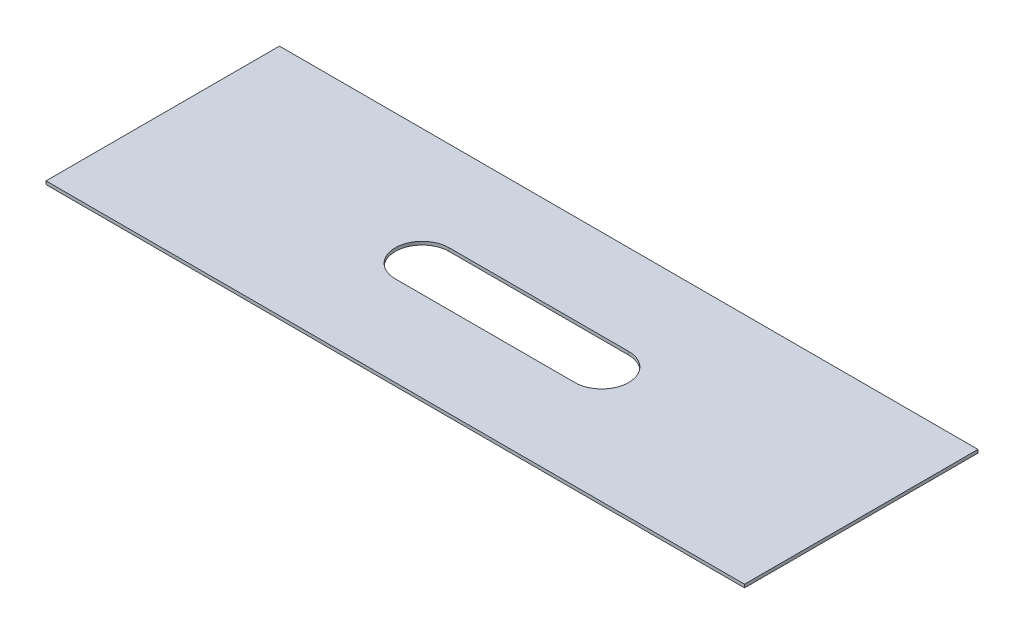
ISO-10303-21;
HEADER;
FILE_DESCRIPTION(('STEP AP214'),'2;1');
FILE_NAME('part.step','',(''),(''),'','','');
FILE_SCHEMA(('AUTOMOTIVE_DESIGN { 1 0 10303 214 1 1 1 1 }'));
ENDSEC;
DATA;
#1=APPLICATION_CONTEXT('core data for automotive mechanical design processes');
#2=APPLICATION_PROTOCOL_DEFINITION('international standard','automotive_design',2000,#1);
#3=PRODUCT_CONTEXT('',#1,'mechanical');
#4=PRODUCT('Part','Part','',(#3));
#5=PRODUCT_RELATED_PRODUCT_CATEGORY('part','',(#4));
#6=PRODUCT_DEFINITION_FORMATION('','',#4);
#7=PRODUCT_DEFINITION_CONTEXT('part definition',#1,'design');
#8=PRODUCT_DEFINITION('design','',#6,#7);
#9=PRODUCT_DEFINITION_SHAPE('','',#8);
#10=(LENGTH_UNIT() NAMED_UNIT(*) SI_UNIT(.MILLI.,.METRE.));
#11=(NAMED_UNIT(*) PLANE_ANGLE_UNIT() SI_UNIT($,.RADIAN.));
#12=(NAMED_UNIT(*) SI_UNIT($,.STERADIAN.) SOLID_ANGLE_UNIT());
#13=UNCERTAINTY_MEASURE_WITH_UNIT(LENGTH_MEASURE(1.E-05),#10,'distance_accuracy_value','');
#14=(GEOMETRIC_REPRESENTATION_CONTEXT(3) GLOBAL_UNCERTAINTY_ASSIGNED_CONTEXT((#13)) GLOBAL_UNIT_ASSIGNED_CONTEXT((#10,
#11,#12)) REPRESENTATION_CONTEXT('',''));
#15=CARTESIAN_POINT('',(0.,0.,0.));
#16=DIRECTION('',(0.,0.,1.));
#17=DIRECTION('',(1.,0.,0.));
#18=AXIS2_PLACEMENT_3D('',#15,#16,#17);
#19=CARTESIAN_POINT('',(-49.403,0.4572,-16.51));
#20=DIRECTION('',(1.,0.,0.));
#21=DIRECTION('',(0.,0.,-1.));
#22=AXIS2_PLACEMENT_3D('',#19,#20,#21);
#23=PLANE('',#22);
#24=DIRECTION('',(0.,0.,1.));
#25=VECTOR('',#24,1.);
#26=CARTESIAN_POINT('',(-49.403,0.,-16.51));
#27=LINE('',#26,#25);
#28=CARTESIAN_POINT('',(-49.403,0.,-16.51));
#29=VERTEX_POINT('',#28);
#30=CARTESIAN_POINT('',(-49.403,0.,16.51));
#31=VERTEX_POINT('',#30);
#32=EDGE_CURVE('E147',#29,#31,#27,.T.);
#33=ORIENTED_EDGE('',*,*,#32,.T.);
#34=DIRECTION('',(0.,-1.,0.));
#35=VECTOR('',#34,1.);
#36=CARTESIAN_POINT('',(-49.403,0.4572,16.51));
#37=LINE('',#36,#35);
#38=CARTESIAN_POINT('',(-49.403,0.4572,16.51));
#39=VERTEX_POINT('',#38);
#40=EDGE_CURVE('E11',#39,#31,#37,.T.);
#41=ORIENTED_EDGE('',*,*,#40,.F.);
#42=DIRECTION('',(0.,0.,1.));
#43=VECTOR('',#42,1.);
#44=CARTESIAN_POINT('',(-49.403,0.4572,-16.51));
#45=LINE('',#44,#43);
#46=CARTESIAN_POINT('',(-49.403,0.4572,-16.51));
#47=VERTEX_POINT('',#46);
#48=EDGE_CURVE('E153',#47,#39,#45,.T.);
#49=ORIENTED_EDGE('',*,*,#48,.F.);
#50=DIRECTION('',(0.,-1.,0.));
#51=VECTOR('',#50,1.);
#52=CARTESIAN_POINT('',(-49.403,0.4572,-16.51));
#53=LINE('',#52,#51);
#54=EDGE_CURVE('E167',#47,#29,#53,.T.);
#55=ORIENTED_EDGE('',*,*,#54,.T.);
#56=EDGE_LOOP('',(#33,#41,#49,#55));
#57=FACE_BOUND('',#56,.T.);
#58=ADVANCED_FACE('F39',(#57),#23,.F.);
#59=CARTESIAN_POINT('',(-49.403,0.4572,16.51));
#60=DIRECTION('',(0.,0.,-1.));
#61=DIRECTION('',(-1.,0.,0.));
#62=AXIS2_PLACEMENT_3D('',#59,#60,#61);
#63=PLANE('',#62);
#64=DIRECTION('',(1.,0.,0.));
#65=VECTOR('',#64,1.);
#66=CARTESIAN_POINT('',(-49.403,0.,16.51));
#67=LINE('',#66,#65);
#68=CARTESIAN_POINT('',(49.403,0.,16.51));
#69=VERTEX_POINT('',#68);
#70=EDGE_CURVE('E171',#31,#69,#67,.T.);
#71=ORIENTED_EDGE('',*,*,#70,.T.);
#72=DIRECTION('',(0.,-1.,0.));
#73=VECTOR('',#72,1.);
#74=CARTESIAN_POINT('',(49.403,0.4572,16.51));
#75=LINE('',#74,#73);
#76=CARTESIAN_POINT('',(49.403,0.4572,16.51));
#77=VERTEX_POINT('',#76);
#78=EDGE_CURVE('E47',#77,#69,#75,.T.);
#79=ORIENTED_EDGE('',*,*,#78,.F.);
#80=DIRECTION('',(1.,0.,0.));
#81=VECTOR('',#80,1.);
#82=CARTESIAN_POINT('',(-49.403,0.4572,16.51));
#83=LINE('',#82,#81);
#84=EDGE_CURVE('E157',#39,#77,#83,.T.);
#85=ORIENTED_EDGE('',*,*,#84,.F.);
#86=ORIENTED_EDGE('',*,*,#40,.T.);
#87=EDGE_LOOP('',(#71,#79,#85,#86));
#88=FACE_BOUND('',#87,.T.);
#89=ADVANCED_FACE('F205',(#88),#63,.F.);
#90=CARTESIAN_POINT('',(49.403,0.4572,-16.51));
#91=DIRECTION('',(-1.,0.,0.));
#92=DIRECTION('',(0.,0.,1.));
#93=AXIS2_PLACEMENT_3D('',#90,#91,#92);
#94=PLANE('',#93);
#95=DIRECTION('',(0.,0.,-1.));
#96=VECTOR('',#95,1.);
#97=CARTESIAN_POINT('',(49.403,0.,-16.51));
#98=LINE('',#97,#96);
#99=CARTESIAN_POINT('',(49.403,0.,-16.51));
#100=VERTEX_POINT('',#99);
#101=EDGE_CURVE('E174',#69,#100,#98,.T.);
#102=ORIENTED_EDGE('',*,*,#101,.T.);
#103=DIRECTION('',(0.,-1.,0.));
#104=VECTOR('',#103,1.);
#105=CARTESIAN_POINT('',(49.403,0.4572,-16.51));
#106=LINE('',#105,#104);
#107=CARTESIAN_POINT('',(49.403,0.4572,-16.51));
#108=VERTEX_POINT('',#107);
#109=EDGE_CURVE('E182',#108,#100,#106,.T.);
#110=ORIENTED_EDGE('',*,*,#109,.F.);
#111=DIRECTION('',(0.,0.,-1.));
#112=VECTOR('',#111,1.);
#113=CARTESIAN_POINT('',(49.403,0.4572,-16.51));
#114=LINE('',#113,#112);
#115=EDGE_CURVE('E161',#77,#108,#114,.T.);
#116=ORIENTED_EDGE('',*,*,#115,.F.);
#117=ORIENTED_EDGE('',*,*,#78,.T.);
#118=EDGE_LOOP('',(#102,#110,#116,#117));
#119=FACE_BOUND('',#118,.T.);
#120=ADVANCED_FACE('F191',(#119),#94,.F.);
#121=CARTESIAN_POINT('',(-49.403,0.4572,-16.51));
#122=DIRECTION('',(0.,0.,1.));
#123=DIRECTION('',(1.,0.,0.));
#124=AXIS2_PLACEMENT_3D('',#121,#122,#123);
#125=PLANE('',#124);
#126=DIRECTION('',(-1.,0.,0.));
#127=VECTOR('',#126,1.);
#128=CARTESIAN_POINT('',(-49.403,0.,-16.51));
#129=LINE('',#128,#127);
#130=EDGE_CURVE('E158',#100,#29,#129,.T.);
#131=ORIENTED_EDGE('',*,*,#130,.T.);
#132=ORIENTED_EDGE('',*,*,#54,.F.);
#133=DIRECTION('',(-1.,0.,0.));
#134=VECTOR('',#133,1.);
#135=CARTESIAN_POINT('',(-49.403,0.4572,-16.51));
#136=LINE('',#135,#134);
#137=EDGE_CURVE('E164',#108,#47,#136,.T.);
#138=ORIENTED_EDGE('',*,*,#137,.F.);
#139=ORIENTED_EDGE('',*,*,#109,.T.);
#140=EDGE_LOOP('',(#131,#132,#138,#139));
#141=FACE_BOUND('',#140,.T.);
#142=ADVANCED_FACE('F198',(#141),#125,.F.);
#143=CARTESIAN_POINT('',(0.,0.4572,0.));
#144=DIRECTION('',(0.,1.,0.));
#145=DIRECTION('',(0.,0.,1.));
#146=AXIS2_PLACEMENT_3D('',#143,#144,#145);
#147=PLANE('',#146);
#148=CARTESIAN_POINT('',(-12.7,0.4572,0.));
#149=DIRECTION('',(0.,1.,0.));
#150=DIRECTION('',(0.,0.,1.));
#151=AXIS2_PLACEMENT_3D('',#148,#149,#150);
#152=CIRCLE('',#151,3.81);
#153=CARTESIAN_POINT('',(-12.7,0.4572,-3.81));
#154=VERTEX_POINT('',#153);
#155=CARTESIAN_POINT('',(-12.7,0.4572,3.81));
#156=VERTEX_POINT('',#155);
#157=EDGE_CURVE('E54',#154,#156,#152,.T.);
#158=ORIENTED_EDGE('',*,*,#157,.F.);
#159=DIRECTION('',(-1.,0.,0.));
#160=VECTOR('',#159,1.);
#161=CARTESIAN_POINT('',(-12.7,0.4572,-3.81));
#162=LINE('',#161,#160);
#163=CARTESIAN_POINT('',(12.7,0.4572,-3.81));
#164=VERTEX_POINT('',#163);
#165=EDGE_CURVE('E125',#164,#154,#162,.T.);
#166=ORIENTED_EDGE('',*,*,#165,.F.);
#167=CARTESIAN_POINT('',(12.7,0.4572,0.));
#168=DIRECTION('',(0.,1.,0.));
#169=DIRECTION('',(0.,0.,1.));
#170=AXIS2_PLACEMENT_3D('',#167,#168,#169);
#171=CIRCLE('',#170,3.81);
#172=CARTESIAN_POINT('',(12.7,0.4572,3.81));
#173=VERTEX_POINT('',#172);
#174=EDGE_CURVE('E129',#173,#164,#171,.T.);
#175=ORIENTED_EDGE('',*,*,#174,.F.);
#176=DIRECTION('',(1.,0.,0.));
#177=VECTOR('',#176,1.);
#178=CARTESIAN_POINT('',(-12.7,0.4572,3.81));
#179=LINE('',#178,#177);
#180=EDGE_CURVE('E138',#156,#173,#179,.T.);
#181=ORIENTED_EDGE('',*,*,#180,.F.);
#182=EDGE_LOOP('',(#158,#166,#175,#181));
#183=FACE_BOUND('',#182,.T.);
#184=ORIENTED_EDGE('',*,*,#48,.T.);
#185=ORIENTED_EDGE('',*,*,#84,.T.);
#186=ORIENTED_EDGE('',*,*,#115,.T.);
#187=ORIENTED_EDGE('',*,*,#137,.T.);
#188=EDGE_LOOP('',(#184,#185,#186,#187));
#189=FACE_BOUND('',#188,.T.);
#190=ADVANCED_FACE('F204',(#183,#189),#147,.T.);
#191=CARTESIAN_POINT('',(0.,0.,0.));
#192=DIRECTION('',(0.,1.,0.));
#193=DIRECTION('',(0.,0.,1.));
#194=AXIS2_PLACEMENT_3D('',#191,#192,#193);
#195=PLANE('',#194);
#196=DIRECTION('',(-1.,0.,0.));
#197=VECTOR('',#196,1.);
#198=CARTESIAN_POINT('',(-12.7,0.,-3.81));
#199=LINE('',#198,#197);
#200=CARTESIAN_POINT('',(12.7,0.,-3.81));
#201=VERTEX_POINT('',#200);
#202=CARTESIAN_POINT('',(-12.7,0.,-3.81));
#203=VERTEX_POINT('',#202);
#204=EDGE_CURVE('E113',#201,#203,#199,.T.);
#205=ORIENTED_EDGE('',*,*,#204,.T.);
#206=CARTESIAN_POINT('',(-12.7,0.,0.));
#207=DIRECTION('',(0.,1.,0.));
#208=DIRECTION('',(0.,0.,1.));
#209=AXIS2_PLACEMENT_3D('',#206,#207,#208);
#210=CIRCLE('',#209,3.81);
#211=CARTESIAN_POINT('',(-12.7,0.,3.81));
#212=VERTEX_POINT('',#211);
#213=EDGE_CURVE('E106',#203,#212,#210,.T.);
#214=ORIENTED_EDGE('',*,*,#213,.T.);
#215=DIRECTION('',(1.,0.,0.));
#216=VECTOR('',#215,1.);
#217=CARTESIAN_POINT('',(-12.7,0.,3.81));
#218=LINE('',#217,#216);
#219=CARTESIAN_POINT('',(12.7,0.,3.81));
#220=VERTEX_POINT('',#219);
#221=EDGE_CURVE('E116',#212,#220,#218,.T.);
#222=ORIENTED_EDGE('',*,*,#221,.T.);
#223=CARTESIAN_POINT('',(12.7,0.,0.));
#224=DIRECTION('',(0.,1.,0.));
#225=DIRECTION('',(0.,0.,1.));
#226=AXIS2_PLACEMENT_3D('',#223,#224,#225);
#227=CIRCLE('',#226,3.81);
#228=EDGE_CURVE('E62',#220,#201,#227,.T.);
#229=ORIENTED_EDGE('',*,*,#228,.T.);
#230=EDGE_LOOP('',(#205,#214,#222,#229));
#231=FACE_BOUND('',#230,.T.);
#232=ORIENTED_EDGE('',*,*,#32,.F.);
#233=ORIENTED_EDGE('',*,*,#130,.F.);
#234=ORIENTED_EDGE('',*,*,#101,.F.);
#235=ORIENTED_EDGE('',*,*,#70,.F.);
#236=EDGE_LOOP('',(#232,#233,#234,#235));
#237=FACE_BOUND('',#236,.T.);
#238=ADVANCED_FACE('F121',(#231,#237),#195,.F.);
#239=CARTESIAN_POINT('',(-12.7,0.,0.));
#240=DIRECTION('',(0.,1.,0.));
#241=DIRECTION('',(0.,0.,1.));
#242=AXIS2_PLACEMENT_3D('',#239,#240,#241);
#243=CYLINDRICAL_SURFACE('',#242,3.81);
#244=ORIENTED_EDGE('',*,*,#157,.T.);
#245=DIRECTION('',(0.,1.,0.));
#246=VECTOR('',#245,1.);
#247=CARTESIAN_POINT('',(-12.7,0.,3.81));
#248=LINE('',#247,#246);
#249=EDGE_CURVE('E102',#212,#156,#248,.T.);
#250=ORIENTED_EDGE('',*,*,#249,.F.);
#251=ORIENTED_EDGE('',*,*,#213,.F.);
#252=DIRECTION('',(0.,1.,0.));
#253=VECTOR('',#252,1.);
#254=CARTESIAN_POINT('',(-12.7,0.,-3.81));
#255=LINE('',#254,#253);
#256=EDGE_CURVE('E144',#203,#154,#255,.T.);
#257=ORIENTED_EDGE('',*,*,#256,.T.);
#258=EDGE_LOOP('',(#244,#250,#251,#257));
#259=FACE_BOUND('',#258,.T.);
#260=ADVANCED_FACE('F104',(#259),#243,.F.);
#261=CARTESIAN_POINT('',(-12.7,0.,-3.81));
#262=DIRECTION('',(0.,0.,-1.));
#263=DIRECTION('',(-1.,0.,0.));
#264=AXIS2_PLACEMENT_3D('',#261,#262,#263);
#265=PLANE('',#264);
#266=ORIENTED_EDGE('',*,*,#165,.T.);
#267=ORIENTED_EDGE('',*,*,#256,.F.);
#268=ORIENTED_EDGE('',*,*,#204,.F.);
#269=DIRECTION('',(0.,1.,0.));
#270=VECTOR('',#269,1.);
#271=CARTESIAN_POINT('',(12.7,0.,-3.81));
#272=LINE('',#271,#270);
#273=EDGE_CURVE('E148',#201,#164,#272,.T.);
#274=ORIENTED_EDGE('',*,*,#273,.T.);
#275=EDGE_LOOP('',(#266,#267,#268,#274));
#276=FACE_BOUND('',#275,.T.);
#277=ADVANCED_FACE('F222',(#276),#265,.F.);
#278=CARTESIAN_POINT('',(12.7,0.,0.));
#279=DIRECTION('',(0.,1.,0.));
#280=DIRECTION('',(0.,0.,1.));
#281=AXIS2_PLACEMENT_3D('',#278,#279,#280);
#282=CYLINDRICAL_SURFACE('',#281,3.81);
#283=ORIENTED_EDGE('',*,*,#174,.T.);
#284=ORIENTED_EDGE('',*,*,#273,.F.);
#285=ORIENTED_EDGE('',*,*,#228,.F.);
#286=DIRECTION('',(0.,1.,0.));
#287=VECTOR('',#286,1.);
#288=CARTESIAN_POINT('',(12.7,0.,3.81));
#289=LINE('',#288,#287);
#290=EDGE_CURVE('E112',#220,#173,#289,.T.);
#291=ORIENTED_EDGE('',*,*,#290,.T.);
#292=EDGE_LOOP('',(#283,#284,#285,#291));
#293=FACE_BOUND('',#292,.T.);
#294=ADVANCED_FACE('F225',(#293),#282,.F.);
#295=CARTESIAN_POINT('',(-12.7,0.,3.81));
#296=DIRECTION('',(0.,0.,1.));
#297=DIRECTION('',(1.,0.,0.));
#298=AXIS2_PLACEMENT_3D('',#295,#296,#297);
#299=PLANE('',#298);
#300=ORIENTED_EDGE('',*,*,#180,.T.);
#301=ORIENTED_EDGE('',*,*,#290,.F.);
#302=ORIENTED_EDGE('',*,*,#221,.F.);
#303=ORIENTED_EDGE('',*,*,#249,.T.);
#304=EDGE_LOOP('',(#300,#301,#302,#303));
#305=FACE_BOUND('',#304,.T.);
#306=ADVANCED_FACE('F117',(#305),#299,.F.);
#307=CLOSED_SHELL('',(#58,#89,#120,#142,#190,#238,#260,#277,#294,#306));
#308=MANIFOLD_SOLID_BREP('B2',#307);
#309=ADVANCED_BREP_SHAPE_REPRESENTATION('',(#18,#308),#14);
#310=SHAPE_DEFINITION_REPRESENTATION(#9,#309);
ENDSEC;
END-ISO-10303-21;
